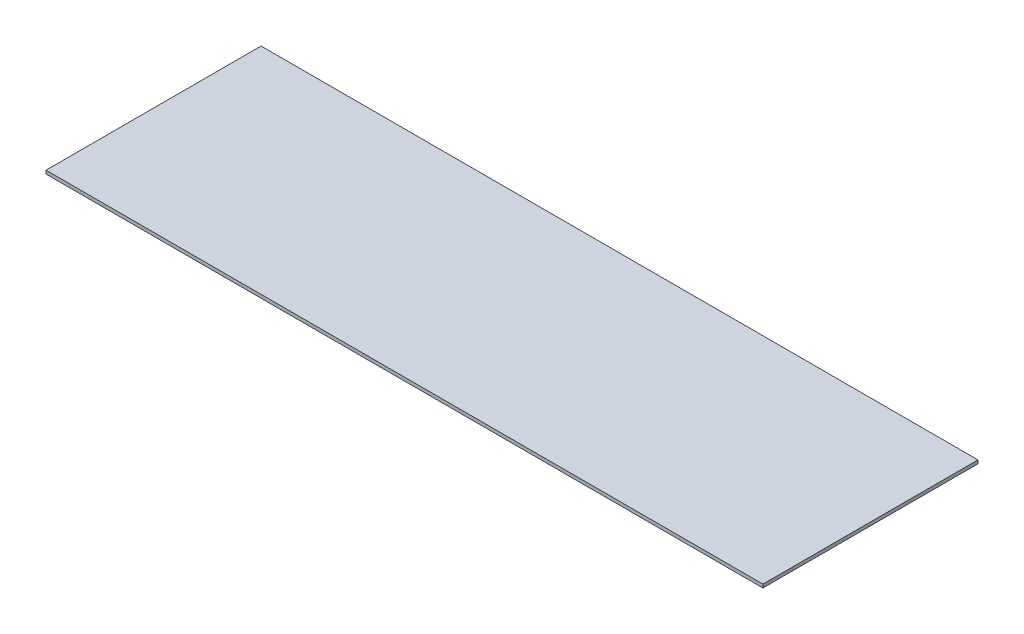
ISO-10303-21;
HEADER;
FILE_DESCRIPTION(('STEP AP214'),'2;1');
FILE_NAME('part.step','',(''),(''),'','','');
FILE_SCHEMA(('AUTOMOTIVE_DESIGN { 1 0 10303 214 1 1 1 1 }'));
ENDSEC;
DATA;
#1=APPLICATION_CONTEXT('core data for automotive mechanical design processes');
#2=APPLICATION_PROTOCOL_DEFINITION('international standard','automotive_design',2000,#1);
#3=PRODUCT_CONTEXT('',#1,'mechanical');
#4=PRODUCT('Part','Part','',(#3));
#5=PRODUCT_RELATED_PRODUCT_CATEGORY('part','',(#4));
#6=PRODUCT_DEFINITION_FORMATION('','',#4);
#7=PRODUCT_DEFINITION_CONTEXT('part definition',#1,'design');
#8=PRODUCT_DEFINITION('design','',#6,#7);
#9=PRODUCT_DEFINITION_SHAPE('','',#8);
#10=(LENGTH_UNIT() NAMED_UNIT(*) SI_UNIT(.MILLI.,.METRE.));
#11=(NAMED_UNIT(*) PLANE_ANGLE_UNIT() SI_UNIT($,.RADIAN.));
#12=(NAMED_UNIT(*) SI_UNIT($,.STERADIAN.) SOLID_ANGLE_UNIT());
#13=UNCERTAINTY_MEASURE_WITH_UNIT(LENGTH_MEASURE(1.E-05),#10,'distance_accuracy_value','');
#14=(GEOMETRIC_REPRESENTATION_CONTEXT(3) GLOBAL_UNCERTAINTY_ASSIGNED_CONTEXT((#13)) GLOBAL_UNIT_ASSIGNED_CONTEXT((#10,
#11,#12)) REPRESENTATION_CONTEXT('',''));
#15=CARTESIAN_POINT('',(0.,0.,0.));
#16=DIRECTION('',(0.,0.,1.));
#17=DIRECTION('',(1.,0.,0.));
#18=AXIS2_PLACEMENT_3D('',#15,#16,#17);
#19=CARTESIAN_POINT('',(0.,4.7625,0.));
#20=DIRECTION('',(0.,1.,0.));
#21=DIRECTION('',(0.,0.,1.));
#22=AXIS2_PLACEMENT_3D('',#19,#20,#21);
#23=PLANE('',#22);
#24=DIRECTION('',(-1.,0.,0.));
#25=VECTOR('',#24,1.);
#26=CARTESIAN_POINT('',(508.,4.7625,-152.4));
#27=LINE('',#26,#25);
#28=CARTESIAN_POINT('',(-508.,4.7625,-152.4));
#29=VERTEX_POINT('',#28);
#30=CARTESIAN_POINT('',(508.,4.7625,-152.4));
#31=VERTEX_POINT('',#30);
#32=EDGE_CURVE('E68',#29,#31,#27,.F.);
#33=ORIENTED_EDGE('',*,*,#32,.F.);
#34=DIRECTION('',(0.,0.,1.));
#35=VECTOR('',#34,1.);
#36=CARTESIAN_POINT('',(-508.,4.7625,-152.4));
#37=LINE('',#36,#35);
#38=CARTESIAN_POINT('',(-508.,4.7625,152.4));
#39=VERTEX_POINT('',#38);
#40=EDGE_CURVE('E20',#39,#29,#37,.F.);
#41=ORIENTED_EDGE('',*,*,#40,.F.);
#42=DIRECTION('',(1.,0.,0.));
#43=VECTOR('',#42,1.);
#44=CARTESIAN_POINT('',(-508.,4.7625,152.4));
#45=LINE('',#44,#43);
#46=CARTESIAN_POINT('',(508.,4.7625,152.4));
#47=VERTEX_POINT('',#46);
#48=EDGE_CURVE('E58',#47,#39,#45,.F.);
#49=ORIENTED_EDGE('',*,*,#48,.F.);
#50=DIRECTION('',(0.,0.,-1.));
#51=VECTOR('',#50,1.);
#52=CARTESIAN_POINT('',(508.,4.7625,152.4));
#53=LINE('',#52,#51);
#54=EDGE_CURVE('E53',#31,#47,#53,.F.);
#55=ORIENTED_EDGE('',*,*,#54,.F.);
#56=EDGE_LOOP('',(#33,#41,#49,#55));
#57=FACE_BOUND('',#56,.T.);
#58=ADVANCED_FACE('F17',(#57),#23,.T.);
#59=CARTESIAN_POINT('',(-508.,0.,-152.4));
#60=DIRECTION('',(-1.,0.,0.));
#61=DIRECTION('',(0.,0.,1.));
#62=AXIS2_PLACEMENT_3D('',#59,#60,#61);
#63=PLANE('',#62);
#64=DIRECTION('',(0.,1.,0.));
#65=VECTOR('',#64,1.);
#66=CARTESIAN_POINT('',(-508.,0.,-152.4));
#67=LINE('',#66,#65);
#68=CARTESIAN_POINT('',(-508.,0.,-152.4));
#69=VERTEX_POINT('',#68);
#70=EDGE_CURVE('E79',#69,#29,#67,.T.);
#71=ORIENTED_EDGE('',*,*,#70,.F.);
#72=DIRECTION('',(0.,0.,1.));
#73=VECTOR('',#72,1.);
#74=CARTESIAN_POINT('',(-508.,0.,0.));
#75=LINE('',#74,#73);
#76=CARTESIAN_POINT('',(-508.,0.,152.4));
#77=VERTEX_POINT('',#76);
#78=EDGE_CURVE('E74',#69,#77,#75,.T.);
#79=ORIENTED_EDGE('',*,*,#78,.T.);
#80=DIRECTION('',(0.,1.,0.));
#81=VECTOR('',#80,1.);
#82=CARTESIAN_POINT('',(-508.,0.,152.4));
#83=LINE('',#82,#81);
#84=EDGE_CURVE('E63',#39,#77,#83,.F.);
#85=ORIENTED_EDGE('',*,*,#84,.F.);
#86=ORIENTED_EDGE('',*,*,#40,.T.);
#87=EDGE_LOOP('',(#71,#79,#85,#86));
#88=FACE_BOUND('',#87,.T.);
#89=ADVANCED_FACE('F73',(#88),#63,.T.);
#90=CARTESIAN_POINT('',(-508.,0.,152.4));
#91=DIRECTION('',(0.,0.,1.));
#92=DIRECTION('',(1.,0.,0.));
#93=AXIS2_PLACEMENT_3D('',#90,#91,#92);
#94=PLANE('',#93);
#95=ORIENTED_EDGE('',*,*,#84,.T.);
#96=DIRECTION('',(1.,0.,0.));
#97=VECTOR('',#96,1.);
#98=CARTESIAN_POINT('',(0.,0.,152.4));
#99=LINE('',#98,#97);
#100=CARTESIAN_POINT('',(508.,0.,152.4));
#101=VERTEX_POINT('',#100);
#102=EDGE_CURVE('E84',#77,#101,#99,.T.);
#103=ORIENTED_EDGE('',*,*,#102,.T.);
#104=DIRECTION('',(0.,1.,0.));
#105=VECTOR('',#104,1.);
#106=CARTESIAN_POINT('',(508.,0.,152.4));
#107=LINE('',#106,#105);
#108=EDGE_CURVE('E65',#47,#101,#107,.F.);
#109=ORIENTED_EDGE('',*,*,#108,.F.);
#110=ORIENTED_EDGE('',*,*,#48,.T.);
#111=EDGE_LOOP('',(#95,#103,#109,#110));
#112=FACE_BOUND('',#111,.T.);
#113=ADVANCED_FACE('F60',(#112),#94,.T.);
#114=CARTESIAN_POINT('',(508.,0.,152.4));
#115=DIRECTION('',(1.,0.,0.));
#116=DIRECTION('',(0.,0.,-1.));
#117=AXIS2_PLACEMENT_3D('',#114,#115,#116);
#118=PLANE('',#117);
#119=ORIENTED_EDGE('',*,*,#108,.T.);
#120=DIRECTION('',(0.,0.,1.));
#121=VECTOR('',#120,1.);
#122=CARTESIAN_POINT('',(508.,0.,0.));
#123=LINE('',#122,#121);
#124=CARTESIAN_POINT('',(508.,0.,-152.4));
#125=VERTEX_POINT('',#124);
#126=EDGE_CURVE('E26',#101,#125,#123,.F.);
#127=ORIENTED_EDGE('',*,*,#126,.T.);
#128=DIRECTION('',(0.,1.,0.));
#129=VECTOR('',#128,1.);
#130=CARTESIAN_POINT('',(508.,0.,-152.4));
#131=LINE('',#130,#129);
#132=EDGE_CURVE('E34',#31,#125,#131,.F.);
#133=ORIENTED_EDGE('',*,*,#132,.F.);
#134=ORIENTED_EDGE('',*,*,#54,.T.);
#135=EDGE_LOOP('',(#119,#127,#133,#134));
#136=FACE_BOUND('',#135,.T.);
#137=ADVANCED_FACE('F88',(#136),#118,.T.);
#138=CARTESIAN_POINT('',(508.,0.,-152.4));
#139=DIRECTION('',(0.,0.,-1.));
#140=DIRECTION('',(-1.,0.,0.));
#141=AXIS2_PLACEMENT_3D('',#138,#139,#140);
#142=PLANE('',#141);
#143=ORIENTED_EDGE('',*,*,#132,.T.);
#144=DIRECTION('',(1.,0.,0.));
#145=VECTOR('',#144,1.);
#146=CARTESIAN_POINT('',(0.,0.,-152.4));
#147=LINE('',#146,#145);
#148=EDGE_CURVE('E11',#125,#69,#147,.F.);
#149=ORIENTED_EDGE('',*,*,#148,.T.);
#150=ORIENTED_EDGE('',*,*,#70,.T.);
#151=ORIENTED_EDGE('',*,*,#32,.T.);
#152=EDGE_LOOP('',(#143,#149,#150,#151));
#153=FACE_BOUND('',#152,.T.);
#154=ADVANCED_FACE('F91',(#153),#142,.T.);
#155=CARTESIAN_POINT('',(0.,0.,0.));
#156=DIRECTION('',(0.,1.,0.));
#157=DIRECTION('',(0.,0.,1.));
#158=AXIS2_PLACEMENT_3D('',#155,#156,#157);
#159=PLANE('',#158);
#160=ORIENTED_EDGE('',*,*,#126,.F.);
#161=ORIENTED_EDGE('',*,*,#102,.F.);
#162=ORIENTED_EDGE('',*,*,#78,.F.);
#163=ORIENTED_EDGE('',*,*,#148,.F.);
#164=EDGE_LOOP('',(#160,#161,#162,#163));
#165=FACE_BOUND('',#164,.T.);
#166=ADVANCED_FACE('F90',(#165),#159,.F.);
#167=CLOSED_SHELL('',(#58,#89,#113,#137,#154,#166));
#168=MANIFOLD_SOLID_BREP('B1',#167);
#169=ADVANCED_BREP_SHAPE_REPRESENTATION('',(#18,#168),#14);
#170=SHAPE_DEFINITION_REPRESENTATION(#9,#169);
ENDSEC;
END-ISO-10303-21;
